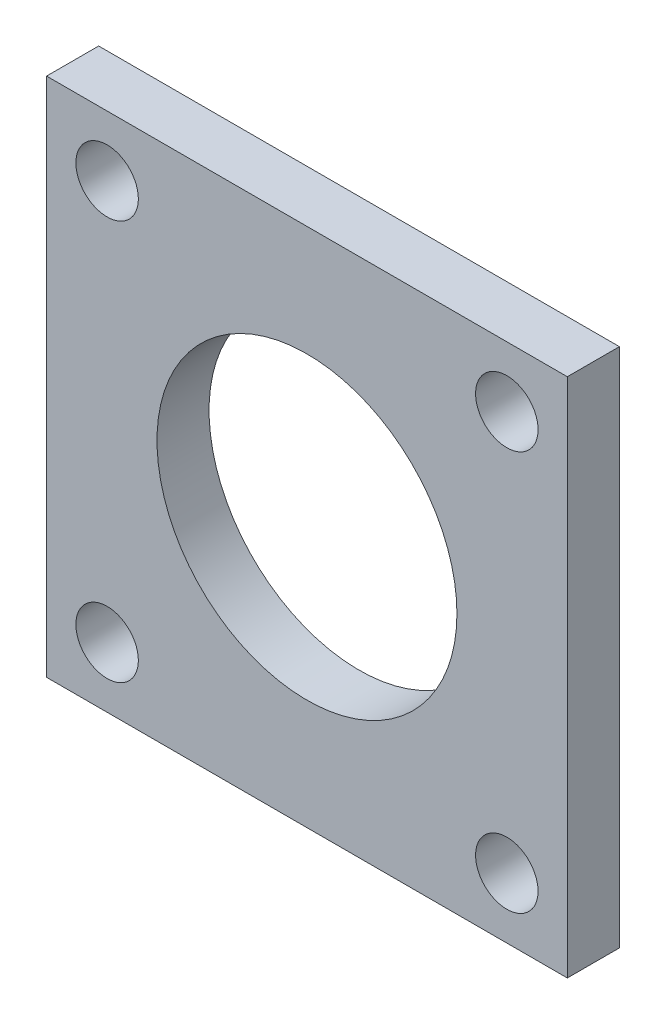
ISO-10303-21;
HEADER;
FILE_DESCRIPTION(('STEP AP214'),'2;1');
FILE_NAME('part.step','',(''),(''),'','','');
FILE_SCHEMA(('AUTOMOTIVE_DESIGN { 1 0 10303 214 1 1 1 1 }'));
ENDSEC;
DATA;
#1=APPLICATION_CONTEXT('core data for automotive mechanical design processes');
#2=APPLICATION_PROTOCOL_DEFINITION('international standard','automotive_design',2000,#1);
#3=PRODUCT_CONTEXT('',#1,'mechanical');
#4=PRODUCT('Part','Part','',(#3));
#5=PRODUCT_RELATED_PRODUCT_CATEGORY('part','',(#4));
#6=PRODUCT_DEFINITION_FORMATION('','',#4);
#7=PRODUCT_DEFINITION_CONTEXT('part definition',#1,'design');
#8=PRODUCT_DEFINITION('design','',#6,#7);
#9=PRODUCT_DEFINITION_SHAPE('','',#8);
#10=(LENGTH_UNIT() NAMED_UNIT(*) SI_UNIT(.MILLI.,.METRE.));
#11=(NAMED_UNIT(*) PLANE_ANGLE_UNIT() SI_UNIT($,.RADIAN.));
#12=(NAMED_UNIT(*) SI_UNIT($,.STERADIAN.) SOLID_ANGLE_UNIT());
#13=UNCERTAINTY_MEASURE_WITH_UNIT(LENGTH_MEASURE(1.E-05),#10,'distance_accuracy_value','');
#14=(GEOMETRIC_REPRESENTATION_CONTEXT(3) GLOBAL_UNCERTAINTY_ASSIGNED_CONTEXT((#13)) GLOBAL_UNIT_ASSIGNED_CONTEXT((#10,
#11,#12)) REPRESENTATION_CONTEXT('',''));
#15=CARTESIAN_POINT('',(0.,0.,0.));
#16=DIRECTION('',(0.,0.,1.));
#17=DIRECTION('',(1.,0.,0.));
#18=AXIS2_PLACEMENT_3D('',#15,#16,#17);
#19=CARTESIAN_POINT('',(0.,0.,2.54));
#20=DIRECTION('',(0.,0.,-1.));
#21=DIRECTION('',(-1.,0.,0.));
#22=AXIS2_PLACEMENT_3D('',#19,#20,#21);
#23=PLANE('',#22);
#24=DIRECTION('',(0.,1.,0.));
#25=VECTOR('',#24,1.);
#26=CARTESIAN_POINT('',(12.7,-12.7,2.54));
#27=LINE('',#26,#25);
#28=CARTESIAN_POINT('',(12.7,-12.7,2.54));
#29=VERTEX_POINT('',#28);
#30=CARTESIAN_POINT('',(12.7,12.7,2.54));
#31=VERTEX_POINT('',#30);
#32=EDGE_CURVE('E92',#29,#31,#27,.T.);
#33=ORIENTED_EDGE('',*,*,#32,.T.);
#34=DIRECTION('',(-1.,0.,0.));
#35=VECTOR('',#34,1.);
#36=CARTESIAN_POINT('',(-12.7,12.7,2.54));
#37=LINE('',#36,#35);
#38=CARTESIAN_POINT('',(-12.7,12.7,2.54));
#39=VERTEX_POINT('',#38);
#40=EDGE_CURVE('E87',#31,#39,#37,.T.);
#41=ORIENTED_EDGE('',*,*,#40,.T.);
#42=DIRECTION('',(0.,-1.,0.));
#43=VECTOR('',#42,1.);
#44=CARTESIAN_POINT('',(-12.7,-12.7,2.54));
#45=LINE('',#44,#43);
#46=CARTESIAN_POINT('',(-12.7,-12.7,2.54));
#47=VERTEX_POINT('',#46);
#48=EDGE_CURVE('E90',#39,#47,#45,.T.);
#49=ORIENTED_EDGE('',*,*,#48,.T.);
#50=DIRECTION('',(1.,0.,0.));
#51=VECTOR('',#50,1.);
#52=CARTESIAN_POINT('',(-12.7,-12.7,2.54));
#53=LINE('',#52,#51);
#54=EDGE_CURVE('E57',#47,#29,#53,.T.);
#55=ORIENTED_EDGE('',*,*,#54,.T.);
#56=EDGE_LOOP('',(#33,#41,#49,#55));
#57=FACE_BOUND('',#56,.T.);
#58=CARTESIAN_POINT('',(0.,0.,2.54));
#59=DIRECTION('',(0.,0.,1.));
#60=DIRECTION('',(1.,0.,0.));
#61=AXIS2_PLACEMENT_3D('',#58,#59,#60);
#62=CIRCLE('',#61,7.3152);
#63=CARTESIAN_POINT('',(7.3152,0.,2.54));
#64=VERTEX_POINT('',#63);
#65=EDGE_CURVE('E112',#64,#64,#62,.T.);
#66=ORIENTED_EDGE('',*,*,#65,.F.);
#67=EDGE_LOOP('',(#66));
#68=FACE_BOUND('',#67,.T.);
#69=CARTESIAN_POINT('',(9.74840085287846,9.74840085287846,2.54));
#70=DIRECTION('',(0.,0.,1.));
#71=DIRECTION('',(1.,0.,0.));
#72=AXIS2_PLACEMENT_3D('',#69,#70,#71);
#73=CIRCLE('',#72,1.524);
#74=CARTESIAN_POINT('',(11.2724008528785,9.74840085287846,2.54));
#75=VERTEX_POINT('',#74);
#76=EDGE_CURVE('E134',#75,#75,#73,.T.);
#77=ORIENTED_EDGE('',*,*,#76,.F.);
#78=EDGE_LOOP('',(#77));
#79=FACE_BOUND('',#78,.T.);
#80=CARTESIAN_POINT('',(-9.74840085287846,-9.74840085287847,2.54));
#81=DIRECTION('',(0.,0.,1.));
#82=DIRECTION('',(1.,0.,0.));
#83=AXIS2_PLACEMENT_3D('',#80,#81,#82);
#84=CIRCLE('',#83,1.524);
#85=CARTESIAN_POINT('',(-8.22440085287846,-9.74840085287847,2.54));
#86=VERTEX_POINT('',#85);
#87=EDGE_CURVE('E142',#86,#86,#84,.T.);
#88=ORIENTED_EDGE('',*,*,#87,.F.);
#89=EDGE_LOOP('',(#88));
#90=FACE_BOUND('',#89,.T.);
#91=CARTESIAN_POINT('',(9.74840085287846,-9.74840085287847,2.54));
#92=DIRECTION('',(0.,0.,1.));
#93=DIRECTION('',(1.,0.,0.));
#94=AXIS2_PLACEMENT_3D('',#91,#92,#93);
#95=CIRCLE('',#94,1.524);
#96=CARTESIAN_POINT('',(11.2724008528785,-9.74840085287847,2.54));
#97=VERTEX_POINT('',#96);
#98=EDGE_CURVE('E150',#97,#97,#95,.T.);
#99=ORIENTED_EDGE('',*,*,#98,.F.);
#100=EDGE_LOOP('',(#99));
#101=FACE_BOUND('',#100,.T.);
#102=CARTESIAN_POINT('',(-9.74840085287846,9.74840085287846,2.54));
#103=DIRECTION('',(0.,0.,1.));
#104=DIRECTION('',(1.,0.,0.));
#105=AXIS2_PLACEMENT_3D('',#102,#103,#104);
#106=CIRCLE('',#105,1.524);
#107=CARTESIAN_POINT('',(-8.22440085287846,9.74840085287846,2.54));
#108=VERTEX_POINT('',#107);
#109=EDGE_CURVE('E158',#108,#108,#106,.T.);
#110=ORIENTED_EDGE('',*,*,#109,.F.);
#111=EDGE_LOOP('',(#110));
#112=FACE_BOUND('',#111,.T.);
#113=ADVANCED_FACE('F39',(#57,#68,#79,#90,#101,#112),#23,.F.);
#114=CARTESIAN_POINT('',(0.,0.,0.));
#115=DIRECTION('',(0.,0.,-1.));
#116=DIRECTION('',(-1.,0.,0.));
#117=AXIS2_PLACEMENT_3D('',#114,#115,#116);
#118=PLANE('',#117);
#119=CARTESIAN_POINT('',(9.74840085287846,-9.74840085287847,0.));
#120=DIRECTION('',(0.,0.,1.));
#121=DIRECTION('',(1.,0.,0.));
#122=AXIS2_PLACEMENT_3D('',#119,#120,#121);
#123=CIRCLE('',#122,1.524);
#124=CARTESIAN_POINT('',(11.2724008528785,-9.74840085287847,0.));
#125=VERTEX_POINT('',#124);
#126=EDGE_CURVE('E154',#125,#125,#123,.T.);
#127=ORIENTED_EDGE('',*,*,#126,.T.);
#128=EDGE_LOOP('',(#127));
#129=FACE_BOUND('',#128,.T.);
#130=CARTESIAN_POINT('',(9.74840085287846,9.74840085287846,0.));
#131=DIRECTION('',(0.,0.,1.));
#132=DIRECTION('',(1.,0.,0.));
#133=AXIS2_PLACEMENT_3D('',#130,#131,#132);
#134=CIRCLE('',#133,1.524);
#135=CARTESIAN_POINT('',(11.2724008528785,9.74840085287846,0.));
#136=VERTEX_POINT('',#135);
#137=EDGE_CURVE('E138',#136,#136,#134,.T.);
#138=ORIENTED_EDGE('',*,*,#137,.T.);
#139=EDGE_LOOP('',(#138));
#140=FACE_BOUND('',#139,.T.);
#141=DIRECTION('',(0.,1.,0.));
#142=VECTOR('',#141,1.);
#143=CARTESIAN_POINT('',(12.7,-12.7,0.));
#144=LINE('',#143,#142);
#145=CARTESIAN_POINT('',(12.7,-12.7,0.));
#146=VERTEX_POINT('',#145);
#147=CARTESIAN_POINT('',(12.7,12.7,0.));
#148=VERTEX_POINT('',#147);
#149=EDGE_CURVE('E108',#146,#148,#144,.T.);
#150=ORIENTED_EDGE('',*,*,#149,.F.);
#151=DIRECTION('',(1.,0.,0.));
#152=VECTOR('',#151,1.);
#153=CARTESIAN_POINT('',(-12.7,-12.7,0.));
#154=LINE('',#153,#152);
#155=CARTESIAN_POINT('',(-12.7,-12.7,0.));
#156=VERTEX_POINT('',#155);
#157=EDGE_CURVE('E80',#156,#146,#154,.T.);
#158=ORIENTED_EDGE('',*,*,#157,.F.);
#159=DIRECTION('',(0.,-1.,0.));
#160=VECTOR('',#159,1.);
#161=CARTESIAN_POINT('',(-12.7,-12.7,0.));
#162=LINE('',#161,#160);
#163=CARTESIAN_POINT('',(-12.7,12.7,0.));
#164=VERTEX_POINT('',#163);
#165=EDGE_CURVE('E74',#164,#156,#162,.T.);
#166=ORIENTED_EDGE('',*,*,#165,.F.);
#167=DIRECTION('',(-1.,0.,0.));
#168=VECTOR('',#167,1.);
#169=CARTESIAN_POINT('',(-12.7,12.7,0.));
#170=LINE('',#169,#168);
#171=EDGE_CURVE('E97',#148,#164,#170,.T.);
#172=ORIENTED_EDGE('',*,*,#171,.F.);
#173=EDGE_LOOP('',(#150,#158,#166,#172));
#174=FACE_BOUND('',#173,.T.);
#175=CARTESIAN_POINT('',(0.,0.,0.));
#176=DIRECTION('',(0.,0.,1.));
#177=DIRECTION('',(1.,0.,0.));
#178=AXIS2_PLACEMENT_3D('',#175,#176,#177);
#179=CIRCLE('',#178,7.3152);
#180=CARTESIAN_POINT('',(7.3152,0.,0.));
#181=VERTEX_POINT('',#180);
#182=EDGE_CURVE('E130',#181,#181,#179,.T.);
#183=ORIENTED_EDGE('',*,*,#182,.T.);
#184=EDGE_LOOP('',(#183));
#185=FACE_BOUND('',#184,.T.);
#186=CARTESIAN_POINT('',(-9.74840085287846,-9.74840085287847,0.));
#187=DIRECTION('',(0.,0.,1.));
#188=DIRECTION('',(1.,0.,0.));
#189=AXIS2_PLACEMENT_3D('',#186,#187,#188);
#190=CIRCLE('',#189,1.524);
#191=CARTESIAN_POINT('',(-8.22440085287846,-9.74840085287847,0.));
#192=VERTEX_POINT('',#191);
#193=EDGE_CURVE('E146',#192,#192,#190,.T.);
#194=ORIENTED_EDGE('',*,*,#193,.T.);
#195=EDGE_LOOP('',(#194));
#196=FACE_BOUND('',#195,.T.);
#197=CARTESIAN_POINT('',(-9.74840085287846,9.74840085287846,0.));
#198=DIRECTION('',(0.,0.,1.));
#199=DIRECTION('',(1.,0.,0.));
#200=AXIS2_PLACEMENT_3D('',#197,#198,#199);
#201=CIRCLE('',#200,1.524);
#202=CARTESIAN_POINT('',(-8.22440085287846,9.74840085287846,0.));
#203=VERTEX_POINT('',#202);
#204=EDGE_CURVE('E162',#203,#203,#201,.T.);
#205=ORIENTED_EDGE('',*,*,#204,.T.);
#206=EDGE_LOOP('',(#205));
#207=FACE_BOUND('',#206,.T.);
#208=ADVANCED_FACE('F125',(#129,#140,#174,#185,#196,#207),#118,.T.);
#209=CARTESIAN_POINT('',(12.7,-12.7,2.54));
#210=DIRECTION('',(-1.,0.,0.));
#211=DIRECTION('',(0.,0.,1.));
#212=AXIS2_PLACEMENT_3D('',#209,#210,#211);
#213=PLANE('',#212);
#214=ORIENTED_EDGE('',*,*,#149,.T.);
#215=DIRECTION('',(0.,0.,-1.));
#216=VECTOR('',#215,1.);
#217=CARTESIAN_POINT('',(12.7,12.7,2.54));
#218=LINE('',#217,#216);
#219=EDGE_CURVE('E11',#31,#148,#218,.T.);
#220=ORIENTED_EDGE('',*,*,#219,.F.);
#221=ORIENTED_EDGE('',*,*,#32,.F.);
#222=DIRECTION('',(0.,0.,-1.));
#223=VECTOR('',#222,1.);
#224=CARTESIAN_POINT('',(12.7,-12.7,2.54));
#225=LINE('',#224,#223);
#226=EDGE_CURVE('E104',#29,#146,#225,.T.);
#227=ORIENTED_EDGE('',*,*,#226,.T.);
#228=EDGE_LOOP('',(#214,#220,#221,#227));
#229=FACE_BOUND('',#228,.T.);
#230=ADVANCED_FACE('F41',(#229),#213,.F.);
#231=CARTESIAN_POINT('',(-12.7,12.7,2.54));
#232=DIRECTION('',(0.,-1.,0.));
#233=DIRECTION('',(0.,0.,-1.));
#234=AXIS2_PLACEMENT_3D('',#231,#232,#233);
#235=PLANE('',#234);
#236=ORIENTED_EDGE('',*,*,#171,.T.);
#237=DIRECTION('',(0.,0.,-1.));
#238=VECTOR('',#237,1.);
#239=CARTESIAN_POINT('',(-12.7,12.7,2.54));
#240=LINE('',#239,#238);
#241=EDGE_CURVE('E49',#39,#164,#240,.T.);
#242=ORIENTED_EDGE('',*,*,#241,.F.);
#243=ORIENTED_EDGE('',*,*,#40,.F.);
#244=ORIENTED_EDGE('',*,*,#219,.T.);
#245=EDGE_LOOP('',(#236,#242,#243,#244));
#246=FACE_BOUND('',#245,.T.);
#247=ADVANCED_FACE('F96',(#246),#235,.F.);
#248=CARTESIAN_POINT('',(-12.7,-12.7,2.54));
#249=DIRECTION('',(1.,0.,0.));
#250=DIRECTION('',(0.,0.,-1.));
#251=AXIS2_PLACEMENT_3D('',#248,#249,#250);
#252=PLANE('',#251);
#253=ORIENTED_EDGE('',*,*,#165,.T.);
#254=DIRECTION('',(0.,0.,-1.));
#255=VECTOR('',#254,1.);
#256=CARTESIAN_POINT('',(-12.7,-12.7,2.54));
#257=LINE('',#256,#255);
#258=EDGE_CURVE('E99',#47,#156,#257,.T.);
#259=ORIENTED_EDGE('',*,*,#258,.F.);
#260=ORIENTED_EDGE('',*,*,#48,.F.);
#261=ORIENTED_EDGE('',*,*,#241,.T.);
#262=EDGE_LOOP('',(#253,#259,#260,#261));
#263=FACE_BOUND('',#262,.T.);
#264=ADVANCED_FACE('F100',(#263),#252,.F.);
#265=CARTESIAN_POINT('',(-12.7,-12.7,2.54));
#266=DIRECTION('',(0.,1.,0.));
#267=DIRECTION('',(0.,0.,1.));
#268=AXIS2_PLACEMENT_3D('',#265,#266,#267);
#269=PLANE('',#268);
#270=ORIENTED_EDGE('',*,*,#157,.T.);
#271=ORIENTED_EDGE('',*,*,#226,.F.);
#272=ORIENTED_EDGE('',*,*,#54,.F.);
#273=ORIENTED_EDGE('',*,*,#258,.T.);
#274=EDGE_LOOP('',(#270,#271,#272,#273));
#275=FACE_BOUND('',#274,.T.);
#276=ADVANCED_FACE('F122',(#275),#269,.F.);
#277=CARTESIAN_POINT('',(0.,0.,2.54));
#278=DIRECTION('',(0.,0.,-1.));
#279=DIRECTION('',(-1.,0.,0.));
#280=AXIS2_PLACEMENT_3D('',#277,#278,#279);
#281=CYLINDRICAL_SURFACE('',#280,7.3152);
#282=ORIENTED_EDGE('',*,*,#65,.T.);
#283=EDGE_LOOP('',(#282));
#284=FACE_BOUND('',#283,.T.);
#285=ORIENTED_EDGE('',*,*,#182,.F.);
#286=EDGE_LOOP('',(#285));
#287=FACE_BOUND('',#286,.T.);
#288=ADVANCED_FACE('F181',(#284,#287),#281,.F.);
#289=CARTESIAN_POINT('',(9.74840085287846,9.74840085287846,2.54));
#290=DIRECTION('',(0.,0.,-1.));
#291=DIRECTION('',(-1.,0.,0.));
#292=AXIS2_PLACEMENT_3D('',#289,#290,#291);
#293=CYLINDRICAL_SURFACE('',#292,1.524);
#294=ORIENTED_EDGE('',*,*,#76,.T.);
#295=EDGE_LOOP('',(#294));
#296=FACE_BOUND('',#295,.T.);
#297=ORIENTED_EDGE('',*,*,#137,.F.);
#298=EDGE_LOOP('',(#297));
#299=FACE_BOUND('',#298,.T.);
#300=ADVANCED_FACE('F227',(#296,#299),#293,.F.);
#301=CARTESIAN_POINT('',(-9.74840085287846,-9.74840085287847,2.54));
#302=DIRECTION('',(0.,0.,-1.));
#303=DIRECTION('',(-1.,0.,0.));
#304=AXIS2_PLACEMENT_3D('',#301,#302,#303);
#305=CYLINDRICAL_SURFACE('',#304,1.524);
#306=ORIENTED_EDGE('',*,*,#87,.T.);
#307=EDGE_LOOP('',(#306));
#308=FACE_BOUND('',#307,.T.);
#309=ORIENTED_EDGE('',*,*,#193,.F.);
#310=EDGE_LOOP('',(#309));
#311=FACE_BOUND('',#310,.T.);
#312=ADVANCED_FACE('F235',(#308,#311),#305,.F.);
#313=CARTESIAN_POINT('',(9.74840085287846,-9.74840085287847,2.54));
#314=DIRECTION('',(0.,0.,-1.));
#315=DIRECTION('',(-1.,0.,0.));
#316=AXIS2_PLACEMENT_3D('',#313,#314,#315);
#317=CYLINDRICAL_SURFACE('',#316,1.524);
#318=ORIENTED_EDGE('',*,*,#98,.T.);
#319=EDGE_LOOP('',(#318));
#320=FACE_BOUND('',#319,.T.);
#321=ORIENTED_EDGE('',*,*,#126,.F.);
#322=EDGE_LOOP('',(#321));
#323=FACE_BOUND('',#322,.T.);
#324=ADVANCED_FACE('F243',(#320,#323),#317,.F.);
#325=CARTESIAN_POINT('',(-9.74840085287846,9.74840085287846,2.54));
#326=DIRECTION('',(0.,0.,-1.));
#327=DIRECTION('',(-1.,0.,0.));
#328=AXIS2_PLACEMENT_3D('',#325,#326,#327);
#329=CYLINDRICAL_SURFACE('',#328,1.524);
#330=ORIENTED_EDGE('',*,*,#109,.T.);
#331=EDGE_LOOP('',(#330));
#332=FACE_BOUND('',#331,.T.);
#333=ORIENTED_EDGE('',*,*,#204,.F.);
#334=EDGE_LOOP('',(#333));
#335=FACE_BOUND('',#334,.T.);
#336=ADVANCED_FACE('F170',(#332,#335),#329,.F.);
#337=CLOSED_SHELL('',(#113,#208,#230,#247,#264,#276,#288,#300,#312,#324,#336));
#338=MANIFOLD_SOLID_BREP('B2',#337);
#339=ADVANCED_BREP_SHAPE_REPRESENTATION('',(#18,#338),#14);
#340=SHAPE_DEFINITION_REPRESENTATION(#9,#339);
ENDSEC;
END-ISO-10303-21;
